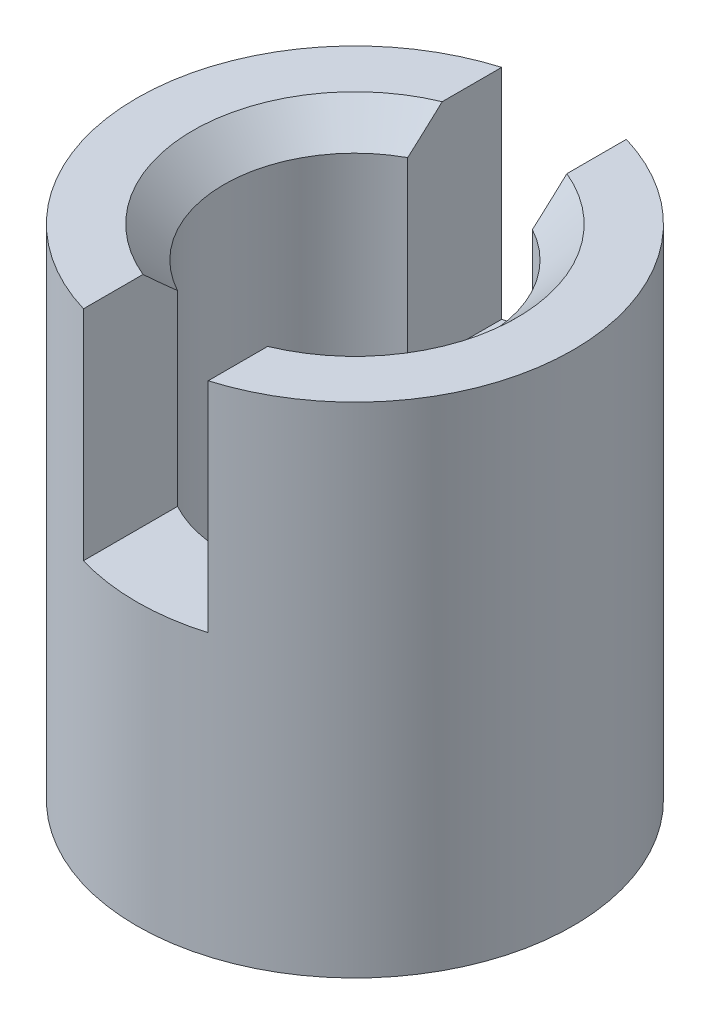
ISO-10303-21;
HEADER;
FILE_DESCRIPTION(('STEP AP214'),'2;1');
FILE_NAME('part.step','',(''),(''),'','','');
FILE_SCHEMA(('AUTOMOTIVE_DESIGN { 1 0 10303 214 1 1 1 1 }'));
ENDSEC;
DATA;
#1=APPLICATION_CONTEXT('core data for automotive mechanical design processes');
#2=APPLICATION_PROTOCOL_DEFINITION('international standard','automotive_design',2000,#1);
#3=PRODUCT_CONTEXT('',#1,'mechanical');
#4=PRODUCT('Part','Part','',(#3));
#5=PRODUCT_RELATED_PRODUCT_CATEGORY('part','',(#4));
#6=PRODUCT_DEFINITION_FORMATION('','',#4);
#7=PRODUCT_DEFINITION_CONTEXT('part definition',#1,'design');
#8=PRODUCT_DEFINITION('design','',#6,#7);
#9=PRODUCT_DEFINITION_SHAPE('','',#8);
#10=(LENGTH_UNIT() NAMED_UNIT(*) SI_UNIT(.MILLI.,.METRE.));
#11=(NAMED_UNIT(*) PLANE_ANGLE_UNIT() SI_UNIT($,.RADIAN.));
#12=(NAMED_UNIT(*) SI_UNIT($,.STERADIAN.) SOLID_ANGLE_UNIT());
#13=UNCERTAINTY_MEASURE_WITH_UNIT(LENGTH_MEASURE(1.E-05),#10,'distance_accuracy_value','');
#14=(GEOMETRIC_REPRESENTATION_CONTEXT(3) GLOBAL_UNCERTAINTY_ASSIGNED_CONTEXT((#13)) GLOBAL_UNIT_ASSIGNED_CONTEXT((#10,
#11,#12)) REPRESENTATION_CONTEXT('',''));
#15=CARTESIAN_POINT('',(0.,0.,0.));
#16=DIRECTION('',(0.,0.,1.));
#17=DIRECTION('',(1.,0.,0.));
#18=AXIS2_PLACEMENT_3D('',#15,#16,#17);
#19=CARTESIAN_POINT('',(-1.64111741986517,6.70798729371791,-1.06642978596483));
#20=DIRECTION('',(0.,1.,0.));
#21=DIRECTION('',(0.,0.,1.));
#22=AXIS2_PLACEMENT_3D('',#19,#20,#21);
#23=PLANE('',#22);
#24=DIRECTION('',(0.,0.,1.));
#25=VECTOR('',#24,1.);
#26=CARTESIAN_POINT('',(-2.64111741986517,6.70798729371791,-5.06642978596483));
#27=LINE('',#26,#25);
#28=CARTESIAN_POINT('',(-2.64111741986517,6.70798729371791,-4.42053175221451));
#29=VERTEX_POINT('',#28);
#30=CARTESIAN_POINT('',(-2.64111741986517,6.70798729371791,-3.46642978596483));
#31=VERTEX_POINT('',#30);
#32=EDGE_CURVE('E97',#29,#31,#27,.T.);
#33=ORIENTED_EDGE('',*,*,#32,.F.);
#34=CARTESIAN_POINT('',(-1.64111741986517,6.70798729371791,-1.06642978596483));
#35=DIRECTION('',(0.,1.,0.));
#36=DIRECTION('',(0.,0.,1.));
#37=AXIS2_PLACEMENT_3D('',#34,#35,#36);
#38=CIRCLE('',#37,3.5);
#39=CARTESIAN_POINT('',(-2.64111741986517,6.70798729371791,2.28767218028486));
#40=VERTEX_POINT('',#39);
#41=EDGE_CURVE('E111',#29,#40,#38,.T.);
#42=ORIENTED_EDGE('',*,*,#41,.T.);
#43=CARTESIAN_POINT('',(-2.64111741986517,6.70798729371791,1.33357021403518));
#44=VERTEX_POINT('',#43);
#45=EDGE_CURVE('E115',#44,#40,#27,.T.);
#46=ORIENTED_EDGE('',*,*,#45,.F.);
#47=CARTESIAN_POINT('',(-1.64111741986517,6.70798729371791,-1.06642978596483));
#48=DIRECTION('',(0.,1.,0.));
#49=DIRECTION('',(0.,0.,1.));
#50=AXIS2_PLACEMENT_3D('',#47,#48,#49);
#51=CIRCLE('',#50,2.6);
#52=EDGE_CURVE('E113',#44,#31,#51,.F.);
#53=ORIENTED_EDGE('',*,*,#52,.T.);
#54=EDGE_LOOP('',(#33,#42,#46,#53));
#55=FACE_BOUND('',#54,.T.);
#56=ADVANCED_FACE('F16',(#55),#23,.T.);
#57=CARTESIAN_POINT('',(-1.64111741986517,6.2079872937179,-1.06642978596483));
#58=DIRECTION('',(0.,1.,0.));
#59=DIRECTION('',(0.,0.,1.));
#60=AXIS2_PLACEMENT_3D('',#57,#58,#59);
#61=CONICAL_SURFACE('',#60,2.1,0.785398163397449);
#62=CARTESIAN_POINT('',(-2.64111741986517,9.84257718650407,-6.71315638094402));
#63=CARTESIAN_POINT('',(-2.64111741986517,9.691070898072,-6.55928453962034));
#64=CARTESIAN_POINT('',(-2.64111741986517,9.5396524175769,-6.40532600382403));
#65=CARTESIAN_POINT('',(-2.64111741986517,9.23691209213933,-6.09701087381646));
#66=CARTESIAN_POINT('',(-2.64111741986517,9.08559049600248,-5.9426540353364));
#67=CARTESIAN_POINT('',(-2.64111741986517,8.78057266214085,-5.63086968825769));
#68=CARTESIAN_POINT('',(-2.64111741986517,8.62688221049119,-5.47343651669312));
#69=CARTESIAN_POINT('',(-2.64111741986517,8.32010927671874,-5.15828510209656));
#70=CARTESIAN_POINT('',(-2.64111741986517,8.16702634028659,-5.00056730162964));
#71=CARTESIAN_POINT('',(-2.64111741986517,7.8942327862006,-4.71836938824932));
#72=CARTESIAN_POINT('',(-2.64111741986517,7.77439934843196,-4.59400806912856));
#73=CARTESIAN_POINT('',(-2.64111741986517,7.53525717185855,-4.34475506994781));
#74=CARTESIAN_POINT('',(-2.64111741986517,7.41594849276265,-4.2198633325584));
#75=CARTESIAN_POINT('',(-2.64111741986517,7.17764166907365,-3.96890083602922));
#76=CARTESIAN_POINT('',(-2.64111741986517,7.05864631461125,-3.84282742261414));
#77=CARTESIAN_POINT('',(-2.64111741986517,6.82181570882307,-3.58969420608994));
#78=CARTESIAN_POINT('',(-2.64111741986517,6.70397998897342,-3.46263484184517));
#79=CARTESIAN_POINT('',(-2.64111741986517,6.47177968692288,-3.20888836723851));
#80=CARTESIAN_POINT('',(-2.64111741986517,6.35738956302799,-3.08222478344521));
#81=CARTESIAN_POINT('',(-2.64111741986517,6.18778748331627,-2.89028593077777));
#82=CARTESIAN_POINT('',(-2.64111741986517,6.13153834606969,-2.82592844960917));
#83=CARTESIAN_POINT('',(-2.64111741986517,6.01998224255308,-2.69640340091672));
#84=CARTESIAN_POINT('',(-2.64111741986517,5.96467524268842,-2.63123586242174));
#85=CARTESIAN_POINT('',(-2.64111741986517,5.85573000284558,-2.50027680899181));
#86=CARTESIAN_POINT('',(-2.64111741986517,5.80208287602771,-2.43449271148452));
#87=CARTESIAN_POINT('',(-2.64111741986517,5.69660894228526,-2.30148660792866));
#88=CARTESIAN_POINT('',(-2.64111741986517,5.64478183253653,-2.23426484411024));
#89=CARTESIAN_POINT('',(-2.64111741986517,5.5439582756909,-2.09798892322979));
#90=CARTESIAN_POINT('',(-2.64111741986517,5.49495488391747,-2.0289399297642));
#91=CARTESIAN_POINT('',(-2.64111741986517,5.40115830296895,-1.88805609302014));
#92=CARTESIAN_POINT('',(-2.64111741986517,5.35636069386189,-1.81622428902247));
#93=CARTESIAN_POINT('',(-2.64111741986517,5.30587362439124,-1.72605979317599));
#94=CARTESIAN_POINT('',(-2.64111741986517,5.29687113685415,-1.7095793133558));
#95=CARTESIAN_POINT('',(-2.64111741986517,5.27925701919173,-1.67640629825623));
#96=CARTESIAN_POINT('',(-2.64111741986517,5.27064547668559,-1.65971371650271));
#97=CARTESIAN_POINT('',(-2.64111741986517,5.24546944242612,-1.60930505865767));
#98=CARTESIAN_POINT('',(-2.64111741986517,5.22956194275806,-1.57525524397548));
#99=CARTESIAN_POINT('',(-2.64111741986517,5.20012161393871,-1.5065550708039));
#100=CARTESIAN_POINT('',(-2.64111741986517,5.18656578075658,-1.47191465874476));
#101=CARTESIAN_POINT('',(-2.64111741986517,5.1621720045795,-1.40167351694823));
#102=CARTESIAN_POINT('',(-2.64111741986517,5.15133392613721,-1.36607283516671));
#103=CARTESIAN_POINT('',(-2.64111741986517,5.13482502192357,-1.3013080451323));
#104=CARTESIAN_POINT('',(-2.64111741986517,5.1285524785534,-1.27229811386533));
#105=CARTESIAN_POINT('',(-2.64111741986517,5.1183884967782,-1.21386652350086));
#106=CARTESIAN_POINT('',(-2.64111741986517,5.11449634669333,-1.18444499015589));
#107=CARTESIAN_POINT('',(-2.64111741986517,5.10929546975645,-1.1254174969254));
#108=CARTESIAN_POINT('',(-2.64111741986517,5.10798257346465,-1.09581191242733));
#109=CARTESIAN_POINT('',(-2.64111741986517,5.10799206385936,-1.03659825035939));
#110=CARTESIAN_POINT('',(-2.64111741986517,5.10931531793933,-1.0069901751754));
#111=CARTESIAN_POINT('',(-2.64111741986517,5.11715256781149,-0.918723126828041));
#112=CARTESIAN_POINT('',(-2.64111741986517,5.12751256645724,-0.860369802457835));
#113=CARTESIAN_POINT('',(-2.64111741986517,5.14935176791376,-0.774497245893519));
#114=CARTESIAN_POINT('',(-2.64111741986517,5.15770196770953,-0.74610002539773));
#115=CARTESIAN_POINT('',(-2.64111741986517,5.17620138040087,-0.689893536414031));
#116=CARTESIAN_POINT('',(-2.64111741986517,5.18635052911146,-0.662084246988844));
#117=CARTESIAN_POINT('',(-2.64111741986517,5.22782025113325,-0.557441953907483));
#118=CARTESIAN_POINT('',(-2.64111741986517,5.26430652843335,-0.482666502562542));
#119=CARTESIAN_POINT('',(-2.64111741986517,5.34429163123424,-0.336934695170644));
#120=CARTESIAN_POINT('',(-2.64111741986517,5.38780848948747,-0.265988803105847));
#121=CARTESIAN_POINT('',(-2.64111741986517,5.47947391802667,-0.126344080915466));
#122=CARTESIAN_POINT('',(-2.64111741986517,5.52765769717472,-0.0576685821046436));
#123=CARTESIAN_POINT('',(-2.64111741986517,5.60197300794022,0.0437566267809005));
#124=CARTESIAN_POINT('',(-2.64111741986517,5.62706882269734,0.0772804317771923));
#125=CARTESIAN_POINT('',(-2.64111741986517,5.67783209705162,0.143891832731579));
#126=CARTESIAN_POINT('',(-2.64111741986517,5.70349953708697,0.176979443555349));
#127=CARTESIAN_POINT('',(-2.64111741986517,5.78833916386491,0.284764629028354));
#128=CARTESIAN_POINT('',(-2.64111741986517,5.84848205277833,0.358697121018856));
#129=CARTESIAN_POINT('',(-2.64111741986517,5.97037175943937,0.505231372356911));
#130=CARTESIAN_POINT('',(-2.64111741986517,6.03211876177196,0.577832976905401));
#131=CARTESIAN_POINT('',(-2.64111741986517,6.1567597223882,0.722085534964313));
#132=CARTESIAN_POINT('',(-2.64111741986517,6.21965406057578,0.793736159505245));
#133=CARTESIAN_POINT('',(-2.64111741986517,6.34626561840626,0.936307619595432));
#134=CARTESIAN_POINT('',(-2.64111741986517,6.40998285727218,1.00722843802657));
#135=CARTESIAN_POINT('',(-2.64111741986517,6.60222184823333,1.21935628150072));
#136=CARTESIAN_POINT('',(-2.64111741986517,6.73165924404672,1.35973261882199));
#137=CARTESIAN_POINT('',(-2.64111741986517,6.99196370981219,1.63909277112564));
#138=CARTESIAN_POINT('',(-2.64111741986517,7.12283048298736,1.77807686410352));
#139=CARTESIAN_POINT('',(-2.64111741986517,7.38490237142505,2.05448242036671));
#140=CARTESIAN_POINT('',(-2.64111741986517,7.5161029776417,2.19190816237379));
#141=CARTESIAN_POINT('',(-2.64111741986517,7.77916543272639,2.4661380249067));
#142=CARTESIAN_POINT('',(-2.64111741986517,7.91102731551089,2.60294211284797));
#143=CARTESIAN_POINT('',(-2.64111741986517,8.30714761806724,3.01251882959611));
#144=CARTESIAN_POINT('',(-2.64111741986517,8.57209862094341,3.28462143330124));
#145=CARTESIAN_POINT('',(-2.64111741986517,8.92107780180103,3.64166394473456));
#146=CARTESIAN_POINT('',(-2.64111741986517,9.00464298271135,3.7270580205668));
#147=CARTESIAN_POINT('',(-2.64111741986517,9.17187367444855,3.8977664731198));
#148=CARTESIAN_POINT('',(-2.64111741986517,9.25553919535133,3.98308083997931));
#149=CARTESIAN_POINT('',(-2.64111741986517,9.42306615137066,4.1537549293413));
#150=CARTESIAN_POINT('',(-2.64111741986517,9.50692769599986,4.23911454430424));
#151=CARTESIAN_POINT('',(-2.64111741986517,9.67470893848727,4.40975784717359));
#152=CARTESIAN_POINT('',(-2.64111741986517,9.7586286288003,4.49504154249834));
#153=CARTESIAN_POINT('',(-2.64111741986517,9.84257718650407,4.58029680901436));
#154=B_SPLINE_CURVE_WITH_KNOTS('',3,(#62,#63,#64,#65,#66,#67,#68,#69,#70,#71,#72,#73,#74,#75,
#76,#77,#78,#79,#80,#81,#82,#83,#84,#85,#86,#87,#88,#89,#90,#91,#92,#93,#94,#95,#96,#97,#98,#99,
#100,#101,#102,#103,#104,#105,#106,#107,#108,#109,#110,#111,#112,#113,#114,#115,#116,#117,#118,
#119,#120,#121,#122,#123,#124,#125,#126,#127,#128,#129,#130,#131,#132,#133,#134,#135,#136,#137,
#138,#139,#140,#141,#142,#143,#144,#145,#146,#147,#148,#149,#150,#151,#152,#153),.UNSPECIFIED.,
.F.,.F.,(4,2,2,2,2,2,2,2,2,2,2,2,2,2,2,2,2,2,2,2,2,2,2,2,2,2,2,2,2,2,2,2,2,2,2,2,2,2,2,2,2,2,2,
2,2,4),(0.,0.647824495283907,1.29629803303243,1.95633802751437,2.61571791551891,3.1338210875526,
3.65198176040919,4.17206301963409,4.69192473020758,5.20391005274234,5.46032655680144,
5.71673389836904,5.97137045354758,6.22596443823819,6.47990290634459,6.73357144658412,
6.78990380105196,6.84624871910462,6.95892882153573,7.07043550632213,7.18193663273838,
7.27089049498849,7.35981774917422,7.44860113115679,7.53741373106421,7.71429221819938,
7.80304937511045,7.89180336587806,8.1406580291232,8.39016142059705,8.64172060816962,
8.76734734948725,8.89296979826807,9.17884818452064,9.46475961372971,9.7507674965707,
10.0367820727047,10.6095928439053,11.1822868634425,11.7522790160437,12.3223007084246,
13.4616577780739,13.8200955654887,14.1785730032173,14.5375593271921,14.8965055378153),.UNSPECIFIED.);
#155=CARTESIAN_POINT('',(-2.64111741986517,6.2079872937179,-2.91304831722677));
#156=VERTEX_POINT('',#155);
#157=EDGE_CURVE('E222',#31,#156,#154,.T.);
#158=ORIENTED_EDGE('',*,*,#157,.F.);
#159=ORIENTED_EDGE('',*,*,#52,.F.);
#160=CARTESIAN_POINT('',(-2.64111741986517,6.2079872937179,0.78018874529711));
#161=VERTEX_POINT('',#160);
#162=EDGE_CURVE('E149',#161,#44,#154,.T.);
#163=ORIENTED_EDGE('',*,*,#162,.F.);
#164=CARTESIAN_POINT('',(-1.64111741986517,6.2079872937179,-1.06642978596483));
#165=DIRECTION('',(0.,1.,0.));
#166=DIRECTION('',(0.,0.,1.));
#167=AXIS2_PLACEMENT_3D('',#164,#165,#166);
#168=CIRCLE('',#167,2.1);
#169=EDGE_CURVE('E125',#156,#161,#168,.T.);
#170=ORIENTED_EDGE('',*,*,#169,.F.);
#171=EDGE_LOOP('',(#158,#159,#163,#170));
#172=FACE_BOUND('',#171,.T.);
#173=ADVANCED_FACE('F176',(#172),#61,.F.);
#174=DIRECTION('',(0.,0.,-1.));
#175=VECTOR('',#174,1.);
#176=CARTESIAN_POINT('',(-0.641117419865169,6.70798729371791,-5.06642978596483));
#177=LINE('',#176,#175);
#178=CARTESIAN_POINT('',(-0.641117419865169,6.70798729371791,2.28767218028486));
#179=VERTEX_POINT('',#178);
#180=CARTESIAN_POINT('',(-0.641117419865169,6.70798729371791,1.33357021403518));
#181=VERTEX_POINT('',#180);
#182=EDGE_CURVE('E39',#179,#181,#177,.T.);
#183=ORIENTED_EDGE('',*,*,#182,.F.);
#184=CARTESIAN_POINT('',(-0.641117419865169,6.70798729371791,-4.42053175221451));
#185=VERTEX_POINT('',#184);
#186=EDGE_CURVE('E121',#179,#185,#38,.T.);
#187=ORIENTED_EDGE('',*,*,#186,.T.);
#188=CARTESIAN_POINT('',(-0.641117419865169,6.70798729371791,-3.46642978596483));
#189=VERTEX_POINT('',#188);
#190=EDGE_CURVE('E114',#189,#185,#177,.T.);
#191=ORIENTED_EDGE('',*,*,#190,.F.);
#192=EDGE_CURVE('E134',#189,#181,#51,.F.);
#193=ORIENTED_EDGE('',*,*,#192,.T.);
#194=EDGE_LOOP('',(#183,#187,#191,#193));
#195=FACE_BOUND('',#194,.T.);
#196=ADVANCED_FACE('F172',(#195),#23,.T.);
#197=CARTESIAN_POINT('',(-1.64111741986517,-1.29201270628209,-1.06642978596483));
#198=DIRECTION('',(0.,1.,0.));
#199=DIRECTION('',(0.,0.,1.));
#200=AXIS2_PLACEMENT_3D('',#197,#198,#199);
#201=PLANE('',#200);
#202=CARTESIAN_POINT('',(-1.64111741986517,-1.29201270628209,-1.06642978596483));
#203=DIRECTION('',(0.,1.,0.));
#204=DIRECTION('',(0.,0.,1.));
#205=AXIS2_PLACEMENT_3D('',#202,#203,#204);
#206=CIRCLE('',#205,2.6);
#207=CARTESIAN_POINT('',(-1.64111741986517,-1.29201270628209,1.53357021403517));
#208=VERTEX_POINT('',#207);
#209=EDGE_CURVE('E136',#208,#208,#206,.T.);
#210=ORIENTED_EDGE('',*,*,#209,.T.);
#211=EDGE_LOOP('',(#210));
#212=FACE_BOUND('',#211,.T.);
#213=CARTESIAN_POINT('',(-1.64111741986517,-1.29201270628209,-1.06642978596483));
#214=DIRECTION('',(0.,1.,0.));
#215=DIRECTION('',(0.,0.,1.));
#216=AXIS2_PLACEMENT_3D('',#213,#214,#215);
#217=CIRCLE('',#216,3.5);
#218=CARTESIAN_POINT('',(-1.64111741986517,-1.29201270628209,2.43357021403517));
#219=VERTEX_POINT('',#218);
#220=EDGE_CURVE('E122',#219,#219,#217,.T.);
#221=ORIENTED_EDGE('',*,*,#220,.F.);
#222=EDGE_LOOP('',(#221));
#223=FACE_BOUND('',#222,.T.);
#224=ADVANCED_FACE('F175',(#212,#223),#201,.F.);
#225=CARTESIAN_POINT('',(-1.64111741986517,6.70798729371791,-1.06642978596483));
#226=DIRECTION('',(0.,-1.,0.));
#227=DIRECTION('',(0.,0.,-1.));
#228=AXIS2_PLACEMENT_3D('',#225,#226,#227);
#229=CYLINDRICAL_SURFACE('',#228,3.5);
#230=ORIENTED_EDGE('',*,*,#41,.F.);
#231=DIRECTION('',(0.,-1.,0.));
#232=VECTOR('',#231,1.);
#233=CARTESIAN_POINT('',(-2.64111741986517,6.70798729371791,-4.42053175221451));
#234=LINE('',#233,#232);
#235=CARTESIAN_POINT('',(-2.64111741986517,3.20798729371791,-4.42053175221451));
#236=VERTEX_POINT('',#235);
#237=EDGE_CURVE('E94',#29,#236,#234,.T.);
#238=ORIENTED_EDGE('',*,*,#237,.T.);
#239=CARTESIAN_POINT('',(-1.64111741986517,3.20798729371791,-1.06642978596483));
#240=DIRECTION('',(0.,1.,0.));
#241=DIRECTION('',(0.,0.,1.));
#242=AXIS2_PLACEMENT_3D('',#239,#240,#241);
#243=CIRCLE('',#242,3.5);
#244=CARTESIAN_POINT('',(-0.641117419865169,3.20798729371791,-4.42053175221451));
#245=VERTEX_POINT('',#244);
#246=EDGE_CURVE('E127',#245,#236,#243,.T.);
#247=ORIENTED_EDGE('',*,*,#246,.F.);
#248=DIRECTION('',(0.,-1.,0.));
#249=VECTOR('',#248,1.);
#250=CARTESIAN_POINT('',(-0.641117419865169,6.70798729371791,-4.42053175221451));
#251=LINE('',#250,#249);
#252=EDGE_CURVE('E212',#245,#185,#251,.F.);
#253=ORIENTED_EDGE('',*,*,#252,.T.);
#254=ORIENTED_EDGE('',*,*,#186,.F.);
#255=DIRECTION('',(0.,-1.,0.));
#256=VECTOR('',#255,1.);
#257=CARTESIAN_POINT('',(-0.641117419865169,6.70798729371791,2.28767218028486));
#258=LINE('',#257,#256);
#259=CARTESIAN_POINT('',(-0.641117419865169,3.20798729371791,2.28767218028486));
#260=VERTEX_POINT('',#259);
#261=EDGE_CURVE('E214',#179,#260,#258,.T.);
#262=ORIENTED_EDGE('',*,*,#261,.T.);
#263=CARTESIAN_POINT('',(-2.64111741986517,3.20798729371791,2.28767218028486));
#264=VERTEX_POINT('',#263);
#265=EDGE_CURVE('E104',#264,#260,#243,.T.);
#266=ORIENTED_EDGE('',*,*,#265,.F.);
#267=DIRECTION('',(0.,-1.,0.));
#268=VECTOR('',#267,1.);
#269=CARTESIAN_POINT('',(-2.64111741986517,6.70798729371791,2.28767218028486));
#270=LINE('',#269,#268);
#271=EDGE_CURVE('E105',#264,#40,#270,.F.);
#272=ORIENTED_EDGE('',*,*,#271,.T.);
#273=EDGE_LOOP('',(#230,#238,#247,#253,#254,#262,#266,#272));
#274=FACE_BOUND('',#273,.T.);
#275=ORIENTED_EDGE('',*,*,#220,.T.);
#276=EDGE_LOOP('',(#275));
#277=FACE_BOUND('',#276,.T.);
#278=ADVANCED_FACE('F118',(#274,#277),#229,.T.);
#279=CARTESIAN_POINT('',(-1.64111741986517,6.70798729371791,-1.06642978596483));
#280=DIRECTION('',(0.,-1.,0.));
#281=DIRECTION('',(0.,0.,-1.));
#282=AXIS2_PLACEMENT_3D('',#279,#280,#281);
#283=CYLINDRICAL_SURFACE('',#282,2.1);
#284=DIRECTION('',(0.,-1.,0.));
#285=VECTOR('',#284,1.);
#286=CARTESIAN_POINT('',(-2.64111741986517,6.70798729371791,-2.91304831722677));
#287=LINE('',#286,#285);
#288=CARTESIAN_POINT('',(-2.64111741986517,3.20798729371791,-2.91304831722677));
#289=VERTEX_POINT('',#288);
#290=EDGE_CURVE('E219',#156,#289,#287,.T.);
#291=ORIENTED_EDGE('',*,*,#290,.F.);
#292=ORIENTED_EDGE('',*,*,#169,.T.);
#293=DIRECTION('',(0.,-1.,0.));
#294=VECTOR('',#293,1.);
#295=CARTESIAN_POINT('',(-2.64111741986517,6.70798729371791,0.78018874529711));
#296=LINE('',#295,#294);
#297=CARTESIAN_POINT('',(-2.64111741986517,3.20798729371791,0.78018874529711));
#298=VERTEX_POINT('',#297);
#299=EDGE_CURVE('E217',#298,#161,#296,.F.);
#300=ORIENTED_EDGE('',*,*,#299,.F.);
#301=CARTESIAN_POINT('',(-1.64111741986517,3.20798729371791,-1.06642978596483));
#302=DIRECTION('',(0.,1.,0.));
#303=DIRECTION('',(0.,0.,1.));
#304=AXIS2_PLACEMENT_3D('',#301,#302,#303);
#305=CIRCLE('',#304,2.1);
#306=CARTESIAN_POINT('',(-0.641117419865169,3.20798729371791,0.780188745297111));
#307=VERTEX_POINT('',#306);
#308=EDGE_CURVE('E20',#298,#307,#305,.T.);
#309=ORIENTED_EDGE('',*,*,#308,.T.);
#310=DIRECTION('',(0.,-1.,0.));
#311=VECTOR('',#310,1.);
#312=CARTESIAN_POINT('',(-0.641117419865169,6.70798729371791,0.780188745297111));
#313=LINE('',#312,#311);
#314=CARTESIAN_POINT('',(-0.641117419865169,6.2079872937179,0.780188745297111));
#315=VERTEX_POINT('',#314);
#316=EDGE_CURVE('E209',#315,#307,#313,.T.);
#317=ORIENTED_EDGE('',*,*,#316,.F.);
#318=CARTESIAN_POINT('',(-0.641117419865169,6.2079872937179,-2.91304831722677));
#319=VERTEX_POINT('',#318);
#320=EDGE_CURVE('E131',#315,#319,#168,.T.);
#321=ORIENTED_EDGE('',*,*,#320,.T.);
#322=DIRECTION('',(0.,-1.,0.));
#323=VECTOR('',#322,1.);
#324=CARTESIAN_POINT('',(-0.641117419865169,6.70798729371791,-2.91304831722677));
#325=LINE('',#324,#323);
#326=CARTESIAN_POINT('',(-0.641117419865169,3.20798729371791,-2.91304831722677));
#327=VERTEX_POINT('',#326);
#328=EDGE_CURVE('E31',#327,#319,#325,.F.);
#329=ORIENTED_EDGE('',*,*,#328,.F.);
#330=EDGE_CURVE('E10',#327,#289,#305,.T.);
#331=ORIENTED_EDGE('',*,*,#330,.T.);
#332=EDGE_LOOP('',(#291,#292,#300,#309,#317,#321,#329,#331));
#333=FACE_BOUND('',#332,.T.);
#334=CARTESIAN_POINT('',(-1.64111741986517,-0.792012706282092,-1.06642978596483));
#335=DIRECTION('',(0.,1.,0.));
#336=DIRECTION('',(0.,0.,1.));
#337=AXIS2_PLACEMENT_3D('',#334,#335,#336);
#338=CIRCLE('',#337,2.1);
#339=CARTESIAN_POINT('',(-1.64111741986517,-0.792012706282092,1.03357021403517));
#340=VERTEX_POINT('',#339);
#341=EDGE_CURVE('E139',#340,#340,#338,.F.);
#342=ORIENTED_EDGE('',*,*,#341,.T.);
#343=EDGE_LOOP('',(#342));
#344=FACE_BOUND('',#343,.T.);
#345=ADVANCED_FACE('F168',(#333,#344),#283,.F.);
#346=CARTESIAN_POINT('',(-0.641117419865169,9.84257718650407,4.58029680901436));
#347=CARTESIAN_POINT('',(-0.641117419865169,9.691070898072,4.42642496769069));
#348=CARTESIAN_POINT('',(-0.641117419865169,9.5396524175769,4.27246643189437));
#349=CARTESIAN_POINT('',(-0.641117419865169,9.23691209213934,3.96415130188681));
#350=CARTESIAN_POINT('',(-0.641117419865169,9.08559049600248,3.80979446340675));
#351=CARTESIAN_POINT('',(-0.641117419865169,8.78057266214085,3.49801011632803));
#352=CARTESIAN_POINT('',(-0.641117419865169,8.6268822104912,3.34057694476347));
#353=CARTESIAN_POINT('',(-0.641117419865169,8.32010927671874,3.02542553016691));
#354=CARTESIAN_POINT('',(-0.641117419865169,8.1670263402866,2.86770772969999));
#355=CARTESIAN_POINT('',(-0.641117419865169,7.8942327862006,2.58550981631967));
#356=CARTESIAN_POINT('',(-0.641117419865169,7.77439934843197,2.46114849719891));
#357=CARTESIAN_POINT('',(-0.641117419865169,7.53525717185856,2.21189549801816));
#358=CARTESIAN_POINT('',(-0.641117419865169,7.41594849276266,2.08700376062875));
#359=CARTESIAN_POINT('',(-0.641117419865169,7.17764166907365,1.83604126409957));
#360=CARTESIAN_POINT('',(-0.641117419865169,7.05864631461125,1.70996785068449));
#361=CARTESIAN_POINT('',(-0.641117419865169,6.82181570882307,1.45683463416028));
#362=CARTESIAN_POINT('',(-0.641117419865169,6.70397998897343,1.32977526991552));
#363=CARTESIAN_POINT('',(-0.641117419865169,6.47177968692288,1.07602879530885));
#364=CARTESIAN_POINT('',(-0.641117419865169,6.35738956302799,0.949365211515553));
#365=CARTESIAN_POINT('',(-0.641117419865169,6.18778748331627,0.757426358848112));
#366=CARTESIAN_POINT('',(-0.641117419865169,6.13153834606969,0.693068877679513));
#367=CARTESIAN_POINT('',(-0.641117419865169,6.01998224255308,0.563543828987065));
#368=CARTESIAN_POINT('',(-0.641117419865169,5.96467524268842,0.49837629049208));
#369=CARTESIAN_POINT('',(-0.641117419865169,5.85573000284558,0.36741723706215));
#370=CARTESIAN_POINT('',(-0.641117419865169,5.80208287602771,0.301633139554865));
#371=CARTESIAN_POINT('',(-0.641117419865169,5.69660894228526,0.168627035999001));
#372=CARTESIAN_POINT('',(-0.641117419865169,5.64478183253653,0.10140527218058));
#373=CARTESIAN_POINT('',(-0.641117419865169,5.5439582756909,-0.0348706486998717));
#374=CARTESIAN_POINT('',(-0.641117419865169,5.49495488391747,-0.103919642165456));
#375=CARTESIAN_POINT('',(-0.641117419865169,5.40115830296895,-0.244803478909521));
#376=CARTESIAN_POINT('',(-0.641117419865169,5.35636069386189,-0.316635282907188));
#377=CARTESIAN_POINT('',(-0.641117419865169,5.30587362439124,-0.406799778753667));
#378=CARTESIAN_POINT('',(-0.641117419865169,5.29687113685415,-0.423280258573859));
#379=CARTESIAN_POINT('',(-0.641117419865169,5.27925701919173,-0.456453273673426));
#380=CARTESIAN_POINT('',(-0.641117419865169,5.27064547668559,-0.473145855426951));
#381=CARTESIAN_POINT('',(-0.641117419865169,5.24546944242612,-0.523554513271991));
#382=CARTESIAN_POINT('',(-0.641117419865169,5.22956194275805,-0.557604327954182));
#383=CARTESIAN_POINT('',(-0.641117419865169,5.2001216139387,-0.626304501125759));
#384=CARTESIAN_POINT('',(-0.641117419865169,5.18656578075658,-0.660944913184899));
#385=CARTESIAN_POINT('',(-0.641117419865169,5.1621720045795,-0.731186054981422));
#386=CARTESIAN_POINT('',(-0.641117419865169,5.1513339261372,-0.766786736762945));
#387=CARTESIAN_POINT('',(-0.641117419865169,5.13482502192357,-0.831551526797357));
#388=CARTESIAN_POINT('',(-0.641117419865169,5.1285524785534,-0.860561458064328));
#389=CARTESIAN_POINT('',(-0.641117419865169,5.1183884967782,-0.918993048428792));
#390=CARTESIAN_POINT('',(-0.641117419865169,5.11449634669332,-0.948414581773763));
#391=CARTESIAN_POINT('',(-0.641117419865169,5.10929546975645,-1.00744207500426));
#392=CARTESIAN_POINT('',(-0.641117419865169,5.10798257346465,-1.03704765950232));
#393=CARTESIAN_POINT('',(-0.641117419865169,5.10799206385936,-1.09626132157027));
#394=CARTESIAN_POINT('',(-0.641117419865169,5.10931531793933,-1.12586939675426));
#395=CARTESIAN_POINT('',(-0.641117419865169,5.11715256781149,-1.21413644510161));
#396=CARTESIAN_POINT('',(-0.641117419865169,5.12751256645723,-1.27248976947182));
#397=CARTESIAN_POINT('',(-0.641117419865169,5.14935176791376,-1.35836232603614));
#398=CARTESIAN_POINT('',(-0.641117419865169,5.15770196770953,-1.38675954653193));
#399=CARTESIAN_POINT('',(-0.641117419865169,5.17620138040087,-1.44296603551562));
#400=CARTESIAN_POINT('',(-0.641117419865169,5.18635052911146,-1.47077532494081));
#401=CARTESIAN_POINT('',(-0.641117419865169,5.22782025113325,-1.57541761802217));
#402=CARTESIAN_POINT('',(-0.641117419865169,5.26430652843335,-1.65019306936711));
#403=CARTESIAN_POINT('',(-0.641117419865169,5.34429163123424,-1.79592487675901));
#404=CARTESIAN_POINT('',(-0.641117419865169,5.38780848948747,-1.86687076882381));
#405=CARTESIAN_POINT('',(-0.641117419865169,5.47947391802666,-2.00651549101419));
#406=CARTESIAN_POINT('',(-0.641117419865169,5.52765769717472,-2.07519098982501));
#407=CARTESIAN_POINT('',(-0.641117419865169,5.60197300794022,-2.17661619871055));
#408=CARTESIAN_POINT('',(-0.641117419865169,5.62706882269734,-2.21014000370684));
#409=CARTESIAN_POINT('',(-0.641117419865169,5.67783209705162,-2.27675140466123));
#410=CARTESIAN_POINT('',(-0.641117419865169,5.70349953708696,-2.309839015485));
#411=CARTESIAN_POINT('',(-0.641117419865169,5.78833916386491,-2.41762420095801));
#412=CARTESIAN_POINT('',(-0.641117419865169,5.84848205277833,-2.49155669294851));
#413=CARTESIAN_POINT('',(-0.641117419865169,5.97037175943937,-2.63809094428656));
#414=CARTESIAN_POINT('',(-0.641117419865169,6.03211876177195,-2.71069254883505));
#415=CARTESIAN_POINT('',(-0.641117419865169,6.15675972238819,-2.85494510689396));
#416=CARTESIAN_POINT('',(-0.641117419865169,6.21965406057577,-2.9265957314349));
#417=CARTESIAN_POINT('',(-0.641117419865169,6.34626561840625,-3.06916719152508));
#418=CARTESIAN_POINT('',(-0.641117419865169,6.40998285727217,-3.14008800995622));
#419=CARTESIAN_POINT('',(-0.641117419865169,6.60222184823332,-3.35221585343037));
#420=CARTESIAN_POINT('',(-0.641117419865169,6.73165924404671,-3.49259219075164));
#421=CARTESIAN_POINT('',(-0.641117419865169,6.99196370981218,-3.77195234305528));
#422=CARTESIAN_POINT('',(-0.641117419865169,7.12283048298735,-3.91093643603316));
#423=CARTESIAN_POINT('',(-0.641117419865169,7.38490237142504,-4.18734199229636));
#424=CARTESIAN_POINT('',(-0.641117419865169,7.51610297764169,-4.32476773430344));
#425=CARTESIAN_POINT('',(-0.641117419865169,7.77916543272638,-4.59899759683635));
#426=CARTESIAN_POINT('',(-0.641117419865169,7.91102731551088,-4.73580168477761));
#427=CARTESIAN_POINT('',(-0.641117419865169,8.30714761806723,-5.14537840152575));
#428=CARTESIAN_POINT('',(-0.641117419865169,8.57209862094339,-5.41748100523089));
#429=CARTESIAN_POINT('',(-0.641117419865169,8.92107780180101,-5.7745235166642));
#430=CARTESIAN_POINT('',(-0.641117419865169,9.00464298271133,-5.85991759249644));
#431=CARTESIAN_POINT('',(-0.641117419865169,9.17187367444853,-6.03062604504944));
#432=CARTESIAN_POINT('',(-0.641117419865169,9.25553919535132,-6.11594041190895));
#433=CARTESIAN_POINT('',(-0.641117419865169,9.42306615137066,-6.28661450127095));
#434=CARTESIAN_POINT('',(-0.641117419865169,9.50692769599986,-6.37197411623389));
#435=CARTESIAN_POINT('',(-0.641117419865169,9.67470893848727,-6.54261741910324));
#436=CARTESIAN_POINT('',(-0.641117419865169,9.7586286288003,-6.62790111442799));
#437=CARTESIAN_POINT('',(-0.641117419865169,9.84257718650407,-6.71315638094402));
#438=B_SPLINE_CURVE_WITH_KNOTS('',3,(#346,#347,#348,#349,#350,#351,#352,#353,#354,#355,#356,
#357,#358,#359,#360,#361,#362,#363,#364,#365,#366,#367,#368,#369,#370,#371,#372,#373,#374,#375,
#376,#377,#378,#379,#380,#381,#382,#383,#384,#385,#386,#387,#388,#389,#390,#391,#392,#393,#394,
#395,#396,#397,#398,#399,#400,#401,#402,#403,#404,#405,#406,#407,#408,#409,#410,#411,#412,#413,
#414,#415,#416,#417,#418,#419,#420,#421,#422,#423,#424,#425,#426,#427,#428,#429,#430,#431,#432,
#433,#434,#435,#436,#437),.UNSPECIFIED.,.F.,.F.,(4,2,2,2,2,2,2,2,2,2,2,2,2,2,2,2,2,2,2,2,2,2,2,
2,2,2,2,2,2,2,2,2,2,2,2,2,2,2,2,2,2,2,2,2,2,4),(0.,0.647824495283904,1.29629803303243,
1.95633802751436,2.6157179155189,3.1338210875526,3.65198176040918,4.17206301963409,
4.69192473020758,5.20391005274234,5.46032655680145,5.71673389836904,5.97137045354759,
6.22596443823819,6.47990290634459,6.73357144658412,6.78990380105197,6.84624871910462,
6.95892882153573,7.07043550632213,7.18193663273838,7.27089049498849,7.35981774917422,
7.44860113115679,7.53741373106421,7.71429221819938,7.80304937511045,7.89180336587806,
8.14065802912319,8.39016142059704,8.64172060816962,8.76734734948724,8.89296979826806,
9.17884818452063,9.4647596137297,9.75076749657069,10.0367820727047,10.6095928439053,
11.1822868634425,11.7522790160437,12.3223007084246,13.4616577780739,13.8200955654886,
14.1785730032173,14.5375593271921,14.8965055378153),.UNSPECIFIED.);
#439=EDGE_CURVE('E148',#181,#315,#438,.T.);
#440=ORIENTED_EDGE('',*,*,#439,.F.);
#441=ORIENTED_EDGE('',*,*,#192,.F.);
#442=EDGE_CURVE('E142',#319,#189,#438,.T.);
#443=ORIENTED_EDGE('',*,*,#442,.F.);
#444=ORIENTED_EDGE('',*,*,#320,.F.);
#445=EDGE_LOOP('',(#440,#441,#443,#444));
#446=FACE_BOUND('',#445,.T.);
#447=ADVANCED_FACE('F155',(#446),#61,.F.);
#448=CARTESIAN_POINT('',(-1.64111741986517,-1.29201270628209,-1.06642978596483));
#449=DIRECTION('',(0.,-1.,0.));
#450=DIRECTION('',(0.,0.,-1.));
#451=AXIS2_PLACEMENT_3D('',#448,#449,#450);
#452=CONICAL_SURFACE('',#451,2.6,0.785398163397447);
#453=ORIENTED_EDGE('',*,*,#341,.F.);
#454=EDGE_LOOP('',(#453));
#455=FACE_BOUND('',#454,.T.);
#456=ORIENTED_EDGE('',*,*,#209,.F.);
#457=EDGE_LOOP('',(#456));
#458=FACE_BOUND('',#457,.T.);
#459=ADVANCED_FACE('F18',(#455,#458),#452,.F.);
#460=CARTESIAN_POINT('',(-2.64111741986517,3.20798729371791,-5.06642978596483));
#461=DIRECTION('',(-1.,0.,0.));
#462=DIRECTION('',(0.,0.,1.));
#463=AXIS2_PLACEMENT_3D('',#460,#461,#462);
#464=PLANE('',#463);
#465=ORIENTED_EDGE('',*,*,#32,.T.);
#466=ORIENTED_EDGE('',*,*,#157,.T.);
#467=ORIENTED_EDGE('',*,*,#290,.T.);
#468=DIRECTION('',(0.,0.,1.));
#469=VECTOR('',#468,1.);
#470=CARTESIAN_POINT('',(-2.64111741986517,3.20798729371791,-5.06642978596483));
#471=LINE('',#470,#469);
#472=EDGE_CURVE('E100',#236,#289,#471,.T.);
#473=ORIENTED_EDGE('',*,*,#472,.F.);
#474=ORIENTED_EDGE('',*,*,#237,.F.);
#475=EDGE_LOOP('',(#465,#466,#467,#473,#474));
#476=FACE_BOUND('',#475,.T.);
#477=ADVANCED_FACE('F96',(#476),#464,.F.);
#478=CARTESIAN_POINT('',(-0.641117419865169,3.20798729371791,-5.06642978596483));
#479=DIRECTION('',(1.,0.,0.));
#480=DIRECTION('',(0.,0.,-1.));
#481=AXIS2_PLACEMENT_3D('',#478,#479,#480);
#482=PLANE('',#481);
#483=DIRECTION('',(0.,0.,-1.));
#484=VECTOR('',#483,1.);
#485=CARTESIAN_POINT('',(-0.641117419865169,3.20798729371791,-5.06642978596483));
#486=LINE('',#485,#484);
#487=EDGE_CURVE('E227',#327,#245,#486,.T.);
#488=ORIENTED_EDGE('',*,*,#487,.F.);
#489=ORIENTED_EDGE('',*,*,#328,.T.);
#490=ORIENTED_EDGE('',*,*,#442,.T.);
#491=ORIENTED_EDGE('',*,*,#190,.T.);
#492=ORIENTED_EDGE('',*,*,#252,.F.);
#493=EDGE_LOOP('',(#488,#489,#490,#491,#492));
#494=FACE_BOUND('',#493,.T.);
#495=ADVANCED_FACE('F163',(#494),#482,.F.);
#496=CARTESIAN_POINT('',(-1.64111741986517,3.20798729371791,-1.06642978596483));
#497=DIRECTION('',(0.,1.,0.));
#498=DIRECTION('',(0.,0.,1.));
#499=AXIS2_PLACEMENT_3D('',#496,#497,#498);
#500=PLANE('',#499);
#501=ORIENTED_EDGE('',*,*,#246,.T.);
#502=ORIENTED_EDGE('',*,*,#472,.T.);
#503=ORIENTED_EDGE('',*,*,#330,.F.);
#504=ORIENTED_EDGE('',*,*,#487,.T.);
#505=EDGE_LOOP('',(#501,#502,#503,#504));
#506=FACE_BOUND('',#505,.T.);
#507=ADVANCED_FACE('F164',(#506),#500,.T.);
#508=ORIENTED_EDGE('',*,*,#265,.T.);
#509=EDGE_CURVE('E210',#260,#307,#486,.T.);
#510=ORIENTED_EDGE('',*,*,#509,.T.);
#511=ORIENTED_EDGE('',*,*,#308,.F.);
#512=EDGE_CURVE('E205',#298,#264,#471,.T.);
#513=ORIENTED_EDGE('',*,*,#512,.T.);
#514=EDGE_LOOP('',(#508,#510,#511,#513));
#515=FACE_BOUND('',#514,.T.);
#516=ADVANCED_FACE('F235',(#515),#500,.T.);
#517=ORIENTED_EDGE('',*,*,#512,.F.);
#518=ORIENTED_EDGE('',*,*,#299,.T.);
#519=ORIENTED_EDGE('',*,*,#162,.T.);
#520=ORIENTED_EDGE('',*,*,#45,.T.);
#521=ORIENTED_EDGE('',*,*,#271,.F.);
#522=EDGE_LOOP('',(#517,#518,#519,#520,#521));
#523=FACE_BOUND('',#522,.T.);
#524=ADVANCED_FACE('F162',(#523),#464,.F.);
#525=ORIENTED_EDGE('',*,*,#182,.T.);
#526=ORIENTED_EDGE('',*,*,#439,.T.);
#527=ORIENTED_EDGE('',*,*,#316,.T.);
#528=ORIENTED_EDGE('',*,*,#509,.F.);
#529=ORIENTED_EDGE('',*,*,#261,.F.);
#530=EDGE_LOOP('',(#525,#526,#527,#528,#529));
#531=FACE_BOUND('',#530,.T.);
#532=ADVANCED_FACE('F158',(#531),#482,.F.);
#533=CLOSED_SHELL('',(#56,#173,#196,#224,#278,#345,#447,#459,#477,#495,#507,#516,#524,#532));
#534=MANIFOLD_SOLID_BREP('B1',#533);
#535=ADVANCED_BREP_SHAPE_REPRESENTATION('',(#18,#534),#14);
#536=SHAPE_DEFINITION_REPRESENTATION(#9,#535);
ENDSEC;
END-ISO-10303-21;
